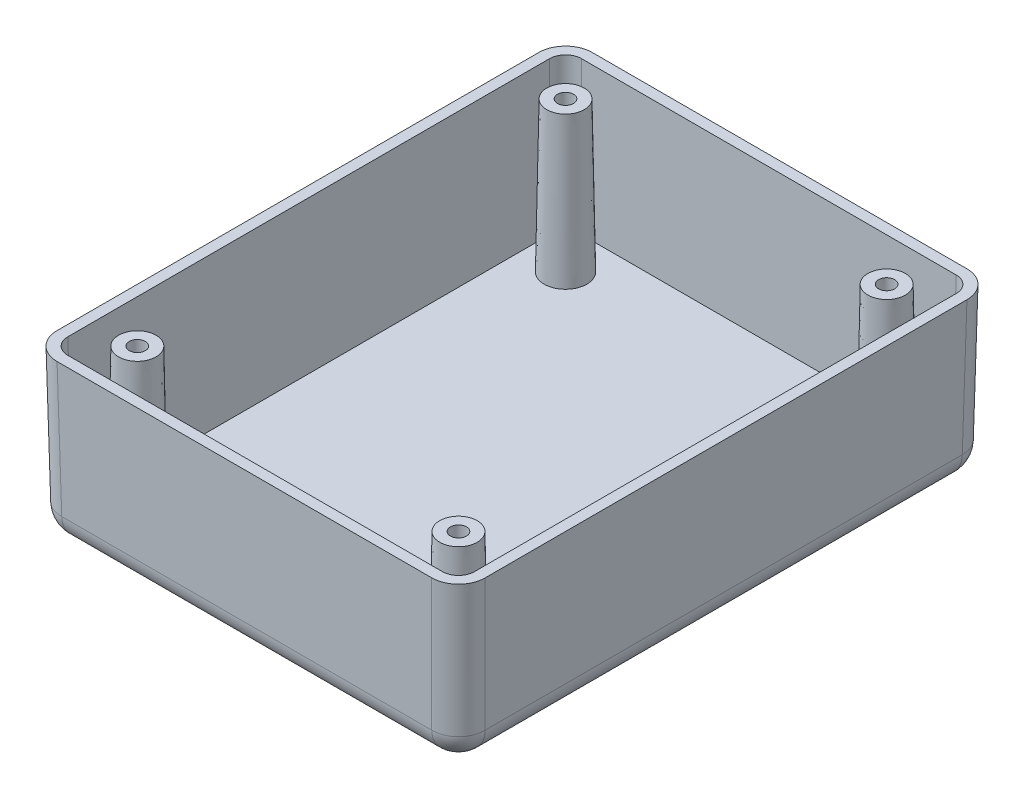
ISO-10303-21;
HEADER;
FILE_DESCRIPTION(('STEP AP214'),'2;1');
FILE_NAME('part.step','',(''),(''),'','','');
FILE_SCHEMA(('AUTOMOTIVE_DESIGN { 1 0 10303 214 1 1 1 1 }'));
ENDSEC;
DATA;
#1=APPLICATION_CONTEXT('core data for automotive mechanical design processes');
#2=APPLICATION_PROTOCOL_DEFINITION('international standard','automotive_design',2000,#1);
#3=PRODUCT_CONTEXT('',#1,'mechanical');
#4=PRODUCT('Part','Part','',(#3));
#5=PRODUCT_RELATED_PRODUCT_CATEGORY('part','',(#4));
#6=PRODUCT_DEFINITION_FORMATION('','',#4);
#7=PRODUCT_DEFINITION_CONTEXT('part definition',#1,'design');
#8=PRODUCT_DEFINITION('design','',#6,#7);
#9=PRODUCT_DEFINITION_SHAPE('','',#8);
#10=(LENGTH_UNIT() NAMED_UNIT(*) SI_UNIT(.MILLI.,.METRE.));
#11=(NAMED_UNIT(*) PLANE_ANGLE_UNIT() SI_UNIT($,.RADIAN.));
#12=(NAMED_UNIT(*) SI_UNIT($,.STERADIAN.) SOLID_ANGLE_UNIT());
#13=UNCERTAINTY_MEASURE_WITH_UNIT(LENGTH_MEASURE(1.E-05),#10,'distance_accuracy_value','');
#14=(GEOMETRIC_REPRESENTATION_CONTEXT(3) GLOBAL_UNCERTAINTY_ASSIGNED_CONTEXT((#13)) GLOBAL_UNIT_ASSIGNED_CONTEXT((#10,
#11,#12)) REPRESENTATION_CONTEXT('',''));
#15=CARTESIAN_POINT('',(0.,0.,0.));
#16=DIRECTION('',(0.,0.,1.));
#17=DIRECTION('',(1.,0.,0.));
#18=AXIS2_PLACEMENT_3D('',#15,#16,#17);
#19=CARTESIAN_POINT('',(-40.,0.,-50.));
#20=DIRECTION('',(-0.999847695156391,-0.0174524064372835,0.));
#21=DIRECTION('',(0.0174524064372835,-0.999847695156391,0.));
#22=AXIS2_PLACEMENT_3D('',#19,#20,#21);
#23=PLANE('',#22);
#24=DIRECTION('',(-0.0174497491606827,0.999695459881888,-0.0174497491606827));
#25=VECTOR('',#24,1.);
#26=CARTESIAN_POINT('',(-40.0015222368495,0.0872088907003297,-45.0022837610676));
#27=LINE('',#26,#25);
#28=CARTESIAN_POINT('',(-40.,0.,-45.0007615242181));
#29=VERTEX_POINT('',#28);
#30=CARTESIAN_POINT('',(-39.562100212357,-25.0872620321864,-44.562861736575));
#31=VERTEX_POINT('',#30);
#32=EDGE_CURVE('E267',#29,#31,#27,.F.);
#33=ORIENTED_EDGE('',*,*,#32,.T.);
#34=DIRECTION('',(0.,0.,1.));
#35=VECTOR('',#34,1.);
#36=CARTESIAN_POINT('',(-39.562100212357,-25.0872620321864,-50.));
#37=LINE('',#36,#35);
#38=CARTESIAN_POINT('',(-39.562100212357,-25.0872620321864,44.562861736575));
#39=VERTEX_POINT('',#38);
#40=EDGE_CURVE('E293',#31,#39,#37,.T.);
#41=ORIENTED_EDGE('',*,*,#40,.T.);
#42=DIRECTION('',(-0.0174497491606827,0.999695459881888,0.0174497491606827));
#43=VECTOR('',#42,1.);
#44=CARTESIAN_POINT('',(-39.9710728622724,-1.6572346105009,44.9718343864904));
#45=LINE('',#44,#43);
#46=CARTESIAN_POINT('',(-40.,0.,45.000761524218));
#47=VERTEX_POINT('',#46);
#48=EDGE_CURVE('E265',#39,#47,#45,.T.);
#49=ORIENTED_EDGE('',*,*,#48,.T.);
#50=DIRECTION('',(0.,0.,1.));
#51=VECTOR('',#50,1.);
#52=CARTESIAN_POINT('',(-40.,0.,-50.));
#53=LINE('',#52,#51);
#54=EDGE_CURVE('E214',#29,#47,#53,.T.);
#55=ORIENTED_EDGE('',*,*,#54,.F.);
#56=EDGE_LOOP('',(#33,#41,#49,#55));
#57=FACE_BOUND('',#56,.T.);
#58=ADVANCED_FACE('F38',(#57),#23,.T.);
#59=CARTESIAN_POINT('',(40.,0.,-50.));
#60=DIRECTION('',(0.,-0.0174524064372835,-0.999847695156391));
#61=DIRECTION('',(0.,0.999847695156391,-0.0174524064372835));
#62=AXIS2_PLACEMENT_3D('',#59,#60,#61);
#63=PLANE('',#62);
#64=DIRECTION('',(0.0174497491606827,0.999695459881888,-0.0174497491606827));
#65=VECTOR('',#64,1.);
#66=CARTESIAN_POINT('',(35.0022837610675,0.0872088907003297,-50.0015222368495));
#67=LINE('',#66,#65);
#68=CARTESIAN_POINT('',(35.000761524218,0.,-50.));
#69=VERTEX_POINT('',#68);
#70=CARTESIAN_POINT('',(34.562861736575,-25.0872620321864,-49.562100212357));
#71=VERTEX_POINT('',#70);
#72=EDGE_CURVE('E263',#69,#71,#67,.F.);
#73=ORIENTED_EDGE('',*,*,#72,.T.);
#74=DIRECTION('',(-1.,0.,0.));
#75=VECTOR('',#74,1.);
#76=CARTESIAN_POINT('',(40.,-25.0872620321864,-49.562100212357));
#77=LINE('',#76,#75);
#78=CARTESIAN_POINT('',(-34.5628617365751,-25.0872620321864,-49.562100212357));
#79=VERTEX_POINT('',#78);
#80=EDGE_CURVE('E11',#71,#79,#77,.T.);
#81=ORIENTED_EDGE('',*,*,#80,.T.);
#82=DIRECTION('',(-0.0174497491606827,0.999695459881888,-0.0174497491606827));
#83=VECTOR('',#82,1.);
#84=CARTESIAN_POINT('',(-34.9779242614059,-1.30834591026065,-49.9771627371879));
#85=LINE('',#84,#83);
#86=CARTESIAN_POINT('',(-35.0007615242181,0.,-50.));
#87=VERTEX_POINT('',#86);
#88=EDGE_CURVE('E261',#79,#87,#85,.T.);
#89=ORIENTED_EDGE('',*,*,#88,.T.);
#90=DIRECTION('',(-1.,0.,0.));
#91=VECTOR('',#90,1.);
#92=CARTESIAN_POINT('',(40.,0.,-50.));
#93=LINE('',#92,#91);
#94=EDGE_CURVE('E241',#69,#87,#93,.T.);
#95=ORIENTED_EDGE('',*,*,#94,.F.);
#96=EDGE_LOOP('',(#73,#81,#89,#95));
#97=FACE_BOUND('',#96,.T.);
#98=ADVANCED_FACE('F411',(#97),#63,.T.);
#99=CARTESIAN_POINT('',(40.,0.,-50.));
#100=DIRECTION('',(0.999847695156391,-0.0174524064372835,0.));
#101=DIRECTION('',(0.0174524064372835,0.999847695156391,0.));
#102=AXIS2_PLACEMENT_3D('',#99,#100,#101);
#103=PLANE('',#102);
#104=DIRECTION('',(0.0174497491606827,0.999695459881888,0.0174497491606827));
#105=VECTOR('',#104,1.);
#106=CARTESIAN_POINT('',(39.9710728622724,-1.6572346105009,44.9718343864904));
#107=LINE('',#106,#105);
#108=CARTESIAN_POINT('',(40.,0.,45.000761524218));
#109=VERTEX_POINT('',#108);
#110=CARTESIAN_POINT('',(39.562100212357,-25.0872620321864,44.562861736575));
#111=VERTEX_POINT('',#110);
#112=EDGE_CURVE('E245',#109,#111,#107,.F.);
#113=ORIENTED_EDGE('',*,*,#112,.T.);
#114=DIRECTION('',(0.,0.,-1.));
#115=VECTOR('',#114,1.);
#116=CARTESIAN_POINT('',(39.5621002123569,-25.0872620321864,-50.));
#117=LINE('',#116,#115);
#118=CARTESIAN_POINT('',(39.562100212357,-25.0872620321864,-44.562861736575));
#119=VERTEX_POINT('',#118);
#120=EDGE_CURVE('E62',#111,#119,#117,.T.);
#121=ORIENTED_EDGE('',*,*,#120,.T.);
#122=DIRECTION('',(0.0174497491606827,0.999695459881888,-0.0174497491606827));
#123=VECTOR('',#122,1.);
#124=CARTESIAN_POINT('',(40.0015222368495,0.0872088907003297,-45.0022837610676));
#125=LINE('',#124,#123);
#126=CARTESIAN_POINT('',(40.,0.,-45.0007615242181));
#127=VERTEX_POINT('',#126);
#128=EDGE_CURVE('E247',#119,#127,#125,.T.);
#129=ORIENTED_EDGE('',*,*,#128,.T.);
#130=DIRECTION('',(0.,0.,-1.));
#131=VECTOR('',#130,1.);
#132=CARTESIAN_POINT('',(40.,0.,-50.));
#133=LINE('',#132,#131);
#134=EDGE_CURVE('E237',#109,#127,#133,.T.);
#135=ORIENTED_EDGE('',*,*,#134,.F.);
#136=EDGE_LOOP('',(#113,#121,#129,#135));
#137=FACE_BOUND('',#136,.T.);
#138=ADVANCED_FACE('F418',(#137),#103,.T.);
#139=CARTESIAN_POINT('',(40.,0.,50.));
#140=DIRECTION('',(0.,-0.0174524064372835,0.999847695156391));
#141=DIRECTION('',(0.,-0.999847695156391,-0.0174524064372835));
#142=AXIS2_PLACEMENT_3D('',#139,#140,#141);
#143=PLANE('',#142);
#144=DIRECTION('',(-0.0174497491606827,0.999695459881888,0.0174497491606827));
#145=VECTOR('',#144,1.);
#146=CARTESIAN_POINT('',(-34.9779242614059,-1.30834591026065,49.9771627371878));
#147=LINE('',#146,#145);
#148=CARTESIAN_POINT('',(-35.000761524218,0.,50.));
#149=VERTEX_POINT('',#148);
#150=CARTESIAN_POINT('',(-34.562861736575,-25.0872620321864,49.562100212357));
#151=VERTEX_POINT('',#150);
#152=EDGE_CURVE('E272',#149,#151,#147,.F.);
#153=ORIENTED_EDGE('',*,*,#152,.T.);
#154=DIRECTION('',(1.,0.,0.));
#155=VECTOR('',#154,1.);
#156=CARTESIAN_POINT('',(40.,-25.0872620321864,49.562100212357));
#157=LINE('',#156,#155);
#158=CARTESIAN_POINT('',(34.562861736575,-25.0872620321864,49.562100212357));
#159=VERTEX_POINT('',#158);
#160=EDGE_CURVE('E306',#151,#159,#157,.T.);
#161=ORIENTED_EDGE('',*,*,#160,.T.);
#162=DIRECTION('',(0.0174497491606827,0.999695459881888,0.0174497491606827));
#163=VECTOR('',#162,1.);
#164=CARTESIAN_POINT('',(35.0022837610675,0.0872088907003298,50.0015222368495));
#165=LINE('',#164,#163);
#166=CARTESIAN_POINT('',(35.000761524218,0.,50.));
#167=VERTEX_POINT('',#166);
#168=EDGE_CURVE('E270',#159,#167,#165,.T.);
#169=ORIENTED_EDGE('',*,*,#168,.T.);
#170=DIRECTION('',(1.,0.,0.));
#171=VECTOR('',#170,1.);
#172=CARTESIAN_POINT('',(40.,0.,50.));
#173=LINE('',#172,#171);
#174=EDGE_CURVE('E233',#149,#167,#173,.T.);
#175=ORIENTED_EDGE('',*,*,#174,.F.);
#176=EDGE_LOOP('',(#153,#161,#169,#175));
#177=FACE_BOUND('',#176,.T.);
#178=ADVANCED_FACE('F424',(#177),#143,.T.);
#179=CARTESIAN_POINT('',(0.,-30.,0.));
#180=DIRECTION('',(0.,-1.,0.));
#181=DIRECTION('',(0.,0.,-1.));
#182=AXIS2_PLACEMENT_3D('',#179,#180,#181);
#183=PLANE('',#182);
#184=DIRECTION('',(1.,0.,0.));
#185=VECTOR('',#184,1.);
#186=CARTESIAN_POINT('',(0.,-30.,44.562861736575));
#187=LINE('',#186,#185);
#188=CARTESIAN_POINT('',(34.562861736575,-30.,44.562861736575));
#189=VERTEX_POINT('',#188);
#190=CARTESIAN_POINT('',(-34.562861736575,-30.,44.562861736575));
#191=VERTEX_POINT('',#190);
#192=EDGE_CURVE('E299',#189,#191,#187,.F.);
#193=ORIENTED_EDGE('',*,*,#192,.T.);
#194=DIRECTION('',(0.,0.,1.));
#195=VECTOR('',#194,1.);
#196=CARTESIAN_POINT('',(-34.562861736575,-30.,0.));
#197=LINE('',#196,#195);
#198=CARTESIAN_POINT('',(-34.5628617365751,-30.,-44.562861736575));
#199=VERTEX_POINT('',#198);
#200=EDGE_CURVE('E301',#191,#199,#197,.F.);
#201=ORIENTED_EDGE('',*,*,#200,.T.);
#202=DIRECTION('',(-1.,0.,0.));
#203=VECTOR('',#202,1.);
#204=CARTESIAN_POINT('',(0.,-30.,-44.562861736575));
#205=LINE('',#204,#203);
#206=CARTESIAN_POINT('',(34.562861736575,-30.,-44.562861736575));
#207=VERTEX_POINT('',#206);
#208=EDGE_CURVE('E295',#199,#207,#205,.F.);
#209=ORIENTED_EDGE('',*,*,#208,.T.);
#210=DIRECTION('',(0.,0.,-1.));
#211=VECTOR('',#210,1.);
#212=CARTESIAN_POINT('',(34.562861736575,-30.,0.));
#213=LINE('',#212,#211);
#214=EDGE_CURVE('E297',#207,#189,#213,.F.);
#215=ORIENTED_EDGE('',*,*,#214,.T.);
#216=EDGE_LOOP('',(#193,#201,#209,#215));
#217=FACE_BOUND('',#216,.T.);
#218=ADVANCED_FACE('F427',(#217),#183,.T.);
#219=CARTESIAN_POINT('',(0.,0.,0.));
#220=DIRECTION('',(0.,-1.,0.));
#221=DIRECTION('',(0.,0.,-1.));
#222=AXIS2_PLACEMENT_3D('',#219,#220,#221);
#223=PLANE('',#222);
#224=DIRECTION('',(0.,0.,-1.));
#225=VECTOR('',#224,1.);
#226=CARTESIAN_POINT('',(37.9996953439122,0.,-50.));
#227=LINE('',#226,#225);
#228=CARTESIAN_POINT('',(37.9996953439122,0.,45.000152258443));
#229=VERTEX_POINT('',#228);
#230=CARTESIAN_POINT('',(37.9996953439122,0.,-45.000152258443));
#231=VERTEX_POINT('',#230);
#232=EDGE_CURVE('E222',#229,#231,#227,.T.);
#233=ORIENTED_EDGE('',*,*,#232,.F.);
#234=CARTESIAN_POINT('',(34.9992383597804,0.,44.9992383597804));
#235=DIRECTION('',(0.,-1.,0.));
#236=DIRECTION('',(0.707106781186548,0.,0.707106781186547));
#237=AXIS2_PLACEMENT_3D('',#234,#235,#236);
#238=ELLIPSE('',#237,3.00091389867315,3.);
#239=CARTESIAN_POINT('',(35.000152258443,0.,47.9996953439122));
#240=VERTEX_POINT('',#239);
#241=EDGE_CURVE('E207',#240,#229,#238,.F.);
#242=ORIENTED_EDGE('',*,*,#241,.F.);
#243=DIRECTION('',(1.,0.,0.));
#244=VECTOR('',#243,1.);
#245=CARTESIAN_POINT('',(40.,0.,47.9996953439122));
#246=LINE('',#245,#244);
#247=CARTESIAN_POINT('',(-35.000152258443,0.,47.9996953439122));
#248=VERTEX_POINT('',#247);
#249=EDGE_CURVE('E217',#248,#240,#246,.T.);
#250=ORIENTED_EDGE('',*,*,#249,.F.);
#251=CARTESIAN_POINT('',(-34.9992383597805,0.,44.9992383597804));
#252=DIRECTION('',(0.,-1.,0.));
#253=DIRECTION('',(-0.707106781186547,0.,0.707106781186548));
#254=AXIS2_PLACEMENT_3D('',#251,#252,#253);
#255=ELLIPSE('',#254,3.00091389867315,3.);
#256=CARTESIAN_POINT('',(-37.9996953439122,0.,45.000152258443));
#257=VERTEX_POINT('',#256);
#258=EDGE_CURVE('E219',#257,#248,#255,.F.);
#259=ORIENTED_EDGE('',*,*,#258,.F.);
#260=DIRECTION('',(0.,0.,1.));
#261=VECTOR('',#260,1.);
#262=CARTESIAN_POINT('',(-37.9996953439122,0.,-50.));
#263=LINE('',#262,#261);
#264=CARTESIAN_POINT('',(-37.9996953439122,0.,-45.000152258443));
#265=VERTEX_POINT('',#264);
#266=EDGE_CURVE('E215',#265,#257,#263,.T.);
#267=ORIENTED_EDGE('',*,*,#266,.F.);
#268=CARTESIAN_POINT('',(-34.9992383597805,0.,-44.9992383597805));
#269=DIRECTION('',(0.,-1.,0.));
#270=DIRECTION('',(-0.707106781186548,0.,-0.707106781186547));
#271=AXIS2_PLACEMENT_3D('',#268,#269,#270);
#272=ELLIPSE('',#271,3.00091389867315,3.);
#273=CARTESIAN_POINT('',(-35.000152258443,0.,-47.9996953439122));
#274=VERTEX_POINT('',#273);
#275=EDGE_CURVE('E171',#274,#265,#272,.F.);
#276=ORIENTED_EDGE('',*,*,#275,.F.);
#277=DIRECTION('',(-1.,0.,0.));
#278=VECTOR('',#277,1.);
#279=CARTESIAN_POINT('',(40.,0.,-47.9996953439122));
#280=LINE('',#279,#278);
#281=CARTESIAN_POINT('',(35.000152258443,0.,-47.9996953439122));
#282=VERTEX_POINT('',#281);
#283=EDGE_CURVE('E185',#282,#274,#280,.T.);
#284=ORIENTED_EDGE('',*,*,#283,.F.);
#285=CARTESIAN_POINT('',(34.9992383597804,0.,-44.9992383597805));
#286=DIRECTION('',(0.,-1.,0.));
#287=DIRECTION('',(0.707106781186547,0.,-0.707106781186548));
#288=AXIS2_PLACEMENT_3D('',#285,#286,#287);
#289=ELLIPSE('',#288,3.00091389867315,3.);
#290=EDGE_CURVE('E204',#231,#282,#289,.F.);
#291=ORIENTED_EDGE('',*,*,#290,.F.);
#292=EDGE_LOOP('',(#233,#242,#250,#259,#267,#276,#284,#291));
#293=FACE_BOUND('',#292,.T.);
#294=ORIENTED_EDGE('',*,*,#134,.T.);
#295=CARTESIAN_POINT('',(34.9992383597804,0.,-44.9992383597805));
#296=DIRECTION('',(0.,-1.,0.));
#297=DIRECTION('',(0.707106781186547,0.,-0.707106781186548));
#298=AXIS2_PLACEMENT_3D('',#295,#296,#297);
#299=ELLIPSE('',#298,5.00152316445525,5.);
#300=EDGE_CURVE('E258',#127,#69,#299,.F.);
#301=ORIENTED_EDGE('',*,*,#300,.T.);
#302=ORIENTED_EDGE('',*,*,#94,.T.);
#303=CARTESIAN_POINT('',(-34.9992383597805,0.,-44.9992383597805));
#304=DIRECTION('',(0.,-1.,0.));
#305=DIRECTION('',(-0.707106781186548,0.,-0.707106781186547));
#306=AXIS2_PLACEMENT_3D('',#303,#304,#305);
#307=ELLIPSE('',#306,5.00152316445525,5.);
#308=EDGE_CURVE('E255',#87,#29,#307,.F.);
#309=ORIENTED_EDGE('',*,*,#308,.T.);
#310=ORIENTED_EDGE('',*,*,#54,.T.);
#311=CARTESIAN_POINT('',(-34.9992383597805,0.,44.9992383597804));
#312=DIRECTION('',(0.,-1.,0.));
#313=DIRECTION('',(-0.707106781186547,0.,0.707106781186548));
#314=AXIS2_PLACEMENT_3D('',#311,#312,#313);
#315=ELLIPSE('',#314,5.00152316445525,5.);
#316=EDGE_CURVE('E252',#47,#149,#315,.F.);
#317=ORIENTED_EDGE('',*,*,#316,.T.);
#318=ORIENTED_EDGE('',*,*,#174,.T.);
#319=CARTESIAN_POINT('',(34.9992383597804,0.,44.9992383597804));
#320=DIRECTION('',(0.,-1.,0.));
#321=DIRECTION('',(0.707106781186548,0.,0.707106781186547));
#322=AXIS2_PLACEMENT_3D('',#319,#320,#321);
#323=ELLIPSE('',#322,5.00152316445525,5.);
#324=EDGE_CURVE('E249',#167,#109,#323,.F.);
#325=ORIENTED_EDGE('',*,*,#324,.T.);
#326=EDGE_LOOP('',(#294,#301,#302,#309,#310,#317,#318,#325));
#327=FACE_BOUND('',#326,.T.);
#328=ADVANCED_FACE('F384',(#293,#327),#223,.F.);
#329=CARTESIAN_POINT('',(35.0022837610675,0.174470922886748,-45.0022837610676));
#330=DIRECTION('',(0.0174497491606827,0.999695459881887,-0.0174497491606827));
#331=DIRECTION('',(0.,0.0174524064372835,0.999847695156391));
#332=AXIS2_PLACEMENT_3D('',#329,#330,#331);
#333=CYLINDRICAL_SURFACE('',#332,5.);
#334=ORIENTED_EDGE('',*,*,#128,.F.);
#335=CARTESIAN_POINT('',(34.562861736575,-25.,-44.562861736575));
#336=DIRECTION('',(0.0174497491606827,0.999695459881887,-0.0174497491606827));
#337=DIRECTION('',(0.,0.0174524064372835,0.999847695156391));
#338=AXIS2_PLACEMENT_3D('',#335,#336,#337);
#339=CIRCLE('',#338,5.);
#340=EDGE_CURVE('E47',#119,#71,#339,.T.);
#341=ORIENTED_EDGE('',*,*,#340,.T.);
#342=ORIENTED_EDGE('',*,*,#72,.F.);
#343=ORIENTED_EDGE('',*,*,#300,.F.);
#344=EDGE_LOOP('',(#334,#341,#342,#343));
#345=FACE_BOUND('',#344,.T.);
#346=ADVANCED_FACE('F431',(#345),#333,.T.);
#347=CARTESIAN_POINT('',(-34.9779242614059,-1.22108387807424,-44.9779242614059));
#348=DIRECTION('',(-0.0174497491606827,0.999695459881887,-0.0174497491606827));
#349=DIRECTION('',(-0.999847695156391,-0.0174524064372836,0.));
#350=AXIS2_PLACEMENT_3D('',#347,#348,#349);
#351=CYLINDRICAL_SURFACE('',#350,5.);
#352=ORIENTED_EDGE('',*,*,#88,.F.);
#353=CARTESIAN_POINT('',(-34.5628617365751,-25.,-44.562861736575));
#354=DIRECTION('',(-0.0174497491606827,0.999695459881887,-0.0174497491606827));
#355=DIRECTION('',(-0.999847695156391,-0.0174524064372836,0.));
#356=AXIS2_PLACEMENT_3D('',#353,#354,#355);
#357=CIRCLE('',#356,5.);
#358=EDGE_CURVE('E275',#79,#31,#357,.T.);
#359=ORIENTED_EDGE('',*,*,#358,.T.);
#360=ORIENTED_EDGE('',*,*,#32,.F.);
#361=ORIENTED_EDGE('',*,*,#308,.F.);
#362=EDGE_LOOP('',(#352,#359,#360,#361));
#363=FACE_BOUND('',#362,.T.);
#364=ADVANCED_FACE('F434',(#363),#351,.T.);
#365=CARTESIAN_POINT('',(-34.9718343864905,-1.56997257831448,44.9718343864904));
#366=DIRECTION('',(-0.0174497491606827,0.999695459881887,0.0174497491606827));
#367=DIRECTION('',(0.,-0.0174524064372835,0.999847695156391));
#368=AXIS2_PLACEMENT_3D('',#365,#366,#367);
#369=CYLINDRICAL_SURFACE('',#368,5.);
#370=ORIENTED_EDGE('',*,*,#48,.F.);
#371=CARTESIAN_POINT('',(-34.562861736575,-25.,44.562861736575));
#372=DIRECTION('',(-0.0174497491606827,0.999695459881887,0.0174497491606827));
#373=DIRECTION('',(0.,-0.0174524064372835,0.999847695156391));
#374=AXIS2_PLACEMENT_3D('',#371,#372,#373);
#375=CIRCLE('',#374,5.);
#376=EDGE_CURVE('E304',#39,#151,#375,.T.);
#377=ORIENTED_EDGE('',*,*,#376,.T.);
#378=ORIENTED_EDGE('',*,*,#152,.F.);
#379=ORIENTED_EDGE('',*,*,#316,.F.);
#380=EDGE_LOOP('',(#370,#377,#378,#379));
#381=FACE_BOUND('',#380,.T.);
#382=ADVANCED_FACE('F437',(#381),#369,.T.);
#383=CARTESIAN_POINT('',(35.0022837610675,0.174470922886748,45.0022837610675));
#384=DIRECTION('',(0.0174497491606827,0.999695459881887,0.0174497491606827));
#385=DIRECTION('',(-0.999847695156391,0.0174524064372836,0.));
#386=AXIS2_PLACEMENT_3D('',#383,#384,#385);
#387=CYLINDRICAL_SURFACE('',#386,5.);
#388=ORIENTED_EDGE('',*,*,#168,.F.);
#389=CARTESIAN_POINT('',(34.562861736575,-25.,44.562861736575));
#390=DIRECTION('',(0.0174497491606827,0.999695459881887,0.0174497491606827));
#391=DIRECTION('',(-0.999847695156391,0.0174524064372836,0.));
#392=AXIS2_PLACEMENT_3D('',#389,#390,#391);
#393=CIRCLE('',#392,5.);
#394=EDGE_CURVE('E308',#159,#111,#393,.T.);
#395=ORIENTED_EDGE('',*,*,#394,.T.);
#396=ORIENTED_EDGE('',*,*,#112,.F.);
#397=ORIENTED_EDGE('',*,*,#324,.F.);
#398=EDGE_LOOP('',(#388,#395,#396,#397));
#399=FACE_BOUND('',#398,.T.);
#400=ADVANCED_FACE('F441',(#399),#387,.T.);
#401=CARTESIAN_POINT('',(-38.0003046096872,0.0349048128745671,-50.));
#402=DIRECTION('',(-0.999847695156391,-0.0174524064372835,0.));
#403=DIRECTION('',(0.0174524064372835,-0.999847695156391,0.));
#404=AXIS2_PLACEMENT_3D('',#401,#402,#403);
#405=PLANE('',#404);
#406=ORIENTED_EDGE('',*,*,#266,.T.);
#407=DIRECTION('',(-0.0174497491606827,0.999695459881887,0.0174497491606827));
#408=VECTOR('',#407,1.);
#409=CARTESIAN_POINT('',(-37.9713774719596,-1.62232979762633,44.9718343864904));
#410=LINE('',#409,#408);
#411=CARTESIAN_POINT('',(-37.5109535259221,-28.,44.5114104404529));
#412=VERTEX_POINT('',#411);
#413=EDGE_CURVE('E176',#412,#257,#410,.T.);
#414=ORIENTED_EDGE('',*,*,#413,.F.);
#415=DIRECTION('',(0.,0.,1.));
#416=VECTOR('',#415,1.);
#417=CARTESIAN_POINT('',(-37.5109535259221,-28.,-50.));
#418=LINE('',#417,#416);
#419=CARTESIAN_POINT('',(-37.5109535259221,-28.,-44.5114104404529));
#420=VERTEX_POINT('',#419);
#421=EDGE_CURVE('E180',#420,#412,#418,.T.);
#422=ORIENTED_EDGE('',*,*,#421,.F.);
#423=DIRECTION('',(-0.0174497491606827,0.999695459881887,-0.0174497491606827));
#424=VECTOR('',#423,1.);
#425=CARTESIAN_POINT('',(-37.9774673468751,-1.27344109738609,-44.9779242614059));
#426=LINE('',#425,#424);
#427=EDGE_CURVE('E164',#265,#420,#426,.F.);
#428=ORIENTED_EDGE('',*,*,#427,.F.);
#429=EDGE_LOOP('',(#406,#414,#422,#428));
#430=FACE_BOUND('',#429,.T.);
#431=ADVANCED_FACE('F181',(#430),#405,.F.);
#432=CARTESIAN_POINT('',(40.,0.0349048128745671,-48.0003046096872));
#433=DIRECTION('',(0.,-0.0174524064372835,-0.999847695156391));
#434=DIRECTION('',(0.,0.999847695156391,-0.0174524064372835));
#435=AXIS2_PLACEMENT_3D('',#432,#433,#434);
#436=PLANE('',#435);
#437=ORIENTED_EDGE('',*,*,#283,.T.);
#438=DIRECTION('',(-0.0174497491606827,0.999695459881887,-0.0174497491606827));
#439=VECTOR('',#438,1.);
#440=CARTESIAN_POINT('',(-34.9779242614059,-1.27344109738609,-47.9774673468751));
#441=LINE('',#440,#439);
#442=CARTESIAN_POINT('',(-34.5114104404529,-28.,-47.5109535259221));
#443=VERTEX_POINT('',#442);
#444=EDGE_CURVE('E202',#443,#274,#441,.T.);
#445=ORIENTED_EDGE('',*,*,#444,.F.);
#446=DIRECTION('',(-1.,0.,0.));
#447=VECTOR('',#446,1.);
#448=CARTESIAN_POINT('',(40.,-28.,-47.5109535259221));
#449=LINE('',#448,#447);
#450=CARTESIAN_POINT('',(34.5114104404529,-28.,-47.5109535259221));
#451=VERTEX_POINT('',#450);
#452=EDGE_CURVE('E190',#451,#443,#449,.T.);
#453=ORIENTED_EDGE('',*,*,#452,.F.);
#454=DIRECTION('',(0.0174497491606827,0.999695459881887,-0.0174497491606827));
#455=VECTOR('',#454,1.);
#456=CARTESIAN_POINT('',(35.0022837610675,0.122113703574897,-48.0018268465367));
#457=LINE('',#456,#455);
#458=EDGE_CURVE('E200',#282,#451,#457,.F.);
#459=ORIENTED_EDGE('',*,*,#458,.F.);
#460=EDGE_LOOP('',(#437,#445,#453,#459));
#461=FACE_BOUND('',#460,.T.);
#462=ADVANCED_FACE('F397',(#461),#436,.F.);
#463=CARTESIAN_POINT('',(38.0003046096872,0.0349048128745671,-50.));
#464=DIRECTION('',(0.999847695156391,-0.0174524064372835,0.));
#465=DIRECTION('',(0.0174524064372835,0.999847695156391,0.));
#466=AXIS2_PLACEMENT_3D('',#463,#464,#465);
#467=PLANE('',#466);
#468=DIRECTION('',(0.,0.,-1.));
#469=VECTOR('',#468,1.);
#470=CARTESIAN_POINT('',(37.5109535259221,-28.,-50.));
#471=LINE('',#470,#469);
#472=CARTESIAN_POINT('',(37.5109535259221,-28.,44.5114104404529));
#473=VERTEX_POINT('',#472);
#474=CARTESIAN_POINT('',(37.5109535259221,-28.,-44.5114104404529));
#475=VERTEX_POINT('',#474);
#476=EDGE_CURVE('E366',#473,#475,#471,.T.);
#477=ORIENTED_EDGE('',*,*,#476,.F.);
#478=DIRECTION('',(0.0174497491606827,0.999695459881887,0.0174497491606827));
#479=VECTOR('',#478,1.);
#480=CARTESIAN_POINT('',(38.0018268465367,0.122113703574897,45.0022837610675));
#481=LINE('',#480,#479);
#482=EDGE_CURVE('E208',#229,#473,#481,.F.);
#483=ORIENTED_EDGE('',*,*,#482,.F.);
#484=ORIENTED_EDGE('',*,*,#232,.T.);
#485=DIRECTION('',(0.0174497491606827,0.999695459881887,-0.0174497491606827));
#486=VECTOR('',#485,1.);
#487=CARTESIAN_POINT('',(38.0018268465367,0.122113703574897,-45.0022837610676));
#488=LINE('',#487,#486);
#489=EDGE_CURVE('E205',#475,#231,#488,.T.);
#490=ORIENTED_EDGE('',*,*,#489,.F.);
#491=EDGE_LOOP('',(#477,#483,#484,#490));
#492=FACE_BOUND('',#491,.T.);
#493=ADVANCED_FACE('F392',(#492),#467,.F.);
#494=CARTESIAN_POINT('',(40.,0.0349048128745671,48.0003046096872));
#495=DIRECTION('',(0.,-0.0174524064372835,0.999847695156391));
#496=DIRECTION('',(0.,-0.999847695156391,-0.0174524064372835));
#497=AXIS2_PLACEMENT_3D('',#494,#495,#496);
#498=PLANE('',#497);
#499=ORIENTED_EDGE('',*,*,#249,.T.);
#500=DIRECTION('',(0.0174497491606827,0.999695459881887,0.0174497491606827));
#501=VECTOR('',#500,1.);
#502=CARTESIAN_POINT('',(35.0022837610675,0.122113703574897,48.0018268465367));
#503=LINE('',#502,#501);
#504=CARTESIAN_POINT('',(34.5114104404529,-28.,47.5109535259221));
#505=VERTEX_POINT('',#504);
#506=EDGE_CURVE('E175',#505,#240,#503,.T.);
#507=ORIENTED_EDGE('',*,*,#506,.F.);
#508=DIRECTION('',(1.,0.,0.));
#509=VECTOR('',#508,1.);
#510=CARTESIAN_POINT('',(40.,-28.,47.5109535259221));
#511=LINE('',#510,#509);
#512=CARTESIAN_POINT('',(-34.5114104404529,-28.,47.5109535259221));
#513=VERTEX_POINT('',#512);
#514=EDGE_CURVE('E184',#513,#505,#511,.T.);
#515=ORIENTED_EDGE('',*,*,#514,.F.);
#516=DIRECTION('',(-0.0174497491606827,0.999695459881887,0.0174497491606827));
#517=VECTOR('',#516,1.);
#518=CARTESIAN_POINT('',(-34.9718343864905,-1.62232979762633,47.9713774719596));
#519=LINE('',#518,#517);
#520=EDGE_CURVE('E212',#248,#513,#519,.F.);
#521=ORIENTED_EDGE('',*,*,#520,.F.);
#522=EDGE_LOOP('',(#499,#507,#515,#521));
#523=FACE_BOUND('',#522,.T.);
#524=ADVANCED_FACE('F376',(#523),#498,.F.);
#525=CARTESIAN_POINT('',(0.,-28.,0.));
#526=DIRECTION('',(0.,-1.,0.));
#527=DIRECTION('',(0.,0.,-1.));
#528=AXIS2_PLACEMENT_3D('',#525,#526,#527);
#529=PLANE('',#528);
#530=CARTESIAN_POINT('',(30.,-28.,40.));
#531=DIRECTION('',(0.,-1.,0.));
#532=DIRECTION('',(0.,0.,-1.));
#533=AXIS2_PLACEMENT_3D('',#530,#531,#532);
#534=CIRCLE('',#533,3.98874181799009);
#535=CARTESIAN_POINT('',(30.,-28.,36.0112581820099));
#536=VERTEX_POINT('',#535);
#537=EDGE_CURVE('E287',#536,#536,#534,.T.);
#538=ORIENTED_EDGE('',*,*,#537,.T.);
#539=EDGE_LOOP('',(#538));
#540=FACE_BOUND('',#539,.T.);
#541=CARTESIAN_POINT('',(30.,-28.,-40.));
#542=DIRECTION('',(0.,-1.,0.));
#543=DIRECTION('',(0.,0.,-1.));
#544=AXIS2_PLACEMENT_3D('',#541,#542,#543);
#545=CIRCLE('',#544,3.98874181799009);
#546=CARTESIAN_POINT('',(30.,-28.,-43.9887418179901));
#547=VERTEX_POINT('',#546);
#548=EDGE_CURVE('E283',#547,#547,#545,.T.);
#549=ORIENTED_EDGE('',*,*,#548,.T.);
#550=EDGE_LOOP('',(#549));
#551=FACE_BOUND('',#550,.T.);
#552=CARTESIAN_POINT('',(-30.,-28.,-40.));
#553=DIRECTION('',(0.,-1.,0.));
#554=DIRECTION('',(0.,0.,-1.));
#555=AXIS2_PLACEMENT_3D('',#552,#553,#554);
#556=CIRCLE('',#555,3.98874181799009);
#557=CARTESIAN_POINT('',(-30.,-28.,-43.9887418179901));
#558=VERTEX_POINT('',#557);
#559=EDGE_CURVE('E279',#558,#558,#556,.T.);
#560=ORIENTED_EDGE('',*,*,#559,.T.);
#561=EDGE_LOOP('',(#560));
#562=FACE_BOUND('',#561,.T.);
#563=CARTESIAN_POINT('',(-30.,-28.,40.));
#564=DIRECTION('',(0.,-1.,0.));
#565=DIRECTION('',(0.,0.,-1.));
#566=AXIS2_PLACEMENT_3D('',#563,#564,#565);
#567=CIRCLE('',#566,3.98874181799009);
#568=CARTESIAN_POINT('',(-30.,-28.,36.0112581820099));
#569=VERTEX_POINT('',#568);
#570=EDGE_CURVE('E218',#569,#569,#567,.T.);
#571=ORIENTED_EDGE('',*,*,#570,.T.);
#572=EDGE_LOOP('',(#571));
#573=FACE_BOUND('',#572,.T.);
#574=ORIENTED_EDGE('',*,*,#452,.T.);
#575=CARTESIAN_POINT('',(-34.5104965417904,-28.,-44.5104965417904));
#576=DIRECTION('',(0.,-1.,0.));
#577=DIRECTION('',(-0.707106781186548,0.,-0.707106781186547));
#578=AXIS2_PLACEMENT_3D('',#575,#576,#577);
#579=ELLIPSE('',#578,3.00091389867315,3.);
#580=EDGE_CURVE('E168',#420,#443,#579,.T.);
#581=ORIENTED_EDGE('',*,*,#580,.F.);
#582=ORIENTED_EDGE('',*,*,#421,.T.);
#583=CARTESIAN_POINT('',(-34.5104965417904,-28.,44.5104965417904));
#584=DIRECTION('',(0.,-1.,0.));
#585=DIRECTION('',(-0.707106781186547,0.,0.707106781186548));
#586=AXIS2_PLACEMENT_3D('',#583,#584,#585);
#587=ELLIPSE('',#586,3.00091389867315,3.);
#588=EDGE_CURVE('E193',#513,#412,#587,.T.);
#589=ORIENTED_EDGE('',*,*,#588,.F.);
#590=ORIENTED_EDGE('',*,*,#514,.T.);
#591=CARTESIAN_POINT('',(34.5104965417904,-28.,44.5104965417904));
#592=DIRECTION('',(0.,-1.,0.));
#593=DIRECTION('',(0.707106781186548,0.,0.707106781186547));
#594=AXIS2_PLACEMENT_3D('',#591,#592,#593);
#595=ELLIPSE('',#594,3.00091389867315,3.);
#596=EDGE_CURVE('E196',#473,#505,#595,.T.);
#597=ORIENTED_EDGE('',*,*,#596,.F.);
#598=ORIENTED_EDGE('',*,*,#476,.T.);
#599=CARTESIAN_POINT('',(34.5104965417903,-28.,-44.5104965417904));
#600=DIRECTION('',(0.,-1.,0.));
#601=DIRECTION('',(0.707106781186547,0.,-0.707106781186548));
#602=AXIS2_PLACEMENT_3D('',#599,#600,#601);
#603=ELLIPSE('',#602,3.00091389867315,3.);
#604=EDGE_CURVE('E192',#451,#475,#603,.T.);
#605=ORIENTED_EDGE('',*,*,#604,.F.);
#606=EDGE_LOOP('',(#574,#581,#582,#589,#590,#597,#598,#605));
#607=FACE_BOUND('',#606,.T.);
#608=ADVANCED_FACE('F187',(#540,#551,#562,#573,#607),#529,.F.);
#609=CARTESIAN_POINT('',(35.0022837610675,0.174470922886748,-45.0022837610676));
#610=DIRECTION('',(0.0174497491606827,0.999695459881887,-0.0174497491606827));
#611=DIRECTION('',(0.,0.0174524064372835,0.999847695156391));
#612=AXIS2_PLACEMENT_3D('',#609,#610,#611);
#613=CYLINDRICAL_SURFACE('',#612,3.);
#614=ORIENTED_EDGE('',*,*,#604,.T.);
#615=ORIENTED_EDGE('',*,*,#489,.T.);
#616=ORIENTED_EDGE('',*,*,#290,.T.);
#617=ORIENTED_EDGE('',*,*,#458,.T.);
#618=EDGE_LOOP('',(#614,#615,#616,#617));
#619=FACE_BOUND('',#618,.T.);
#620=ADVANCED_FACE('F394',(#619),#613,.F.);
#621=CARTESIAN_POINT('',(-34.9779242614059,-1.22108387807424,-44.9779242614059));
#622=DIRECTION('',(-0.0174497491606827,0.999695459881887,-0.0174497491606827));
#623=DIRECTION('',(-0.999847695156391,-0.0174524064372836,0.));
#624=AXIS2_PLACEMENT_3D('',#621,#622,#623);
#625=CYLINDRICAL_SURFACE('',#624,3.);
#626=ORIENTED_EDGE('',*,*,#580,.T.);
#627=ORIENTED_EDGE('',*,*,#444,.T.);
#628=ORIENTED_EDGE('',*,*,#275,.T.);
#629=ORIENTED_EDGE('',*,*,#427,.T.);
#630=EDGE_LOOP('',(#626,#627,#628,#629));
#631=FACE_BOUND('',#630,.T.);
#632=ADVANCED_FACE('F166',(#631),#625,.F.);
#633=CARTESIAN_POINT('',(-34.9718343864905,-1.56997257831448,44.9718343864904));
#634=DIRECTION('',(-0.0174497491606827,0.999695459881887,0.0174497491606827));
#635=DIRECTION('',(0.,-0.0174524064372835,0.999847695156391));
#636=AXIS2_PLACEMENT_3D('',#633,#634,#635);
#637=CYLINDRICAL_SURFACE('',#636,3.);
#638=ORIENTED_EDGE('',*,*,#588,.T.);
#639=ORIENTED_EDGE('',*,*,#413,.T.);
#640=ORIENTED_EDGE('',*,*,#258,.T.);
#641=ORIENTED_EDGE('',*,*,#520,.T.);
#642=EDGE_LOOP('',(#638,#639,#640,#641));
#643=FACE_BOUND('',#642,.T.);
#644=ADVANCED_FACE('F399',(#643),#637,.F.);
#645=CARTESIAN_POINT('',(35.0022837610675,0.174470922886748,45.0022837610675));
#646=DIRECTION('',(0.0174497491606827,0.999695459881887,0.0174497491606827));
#647=DIRECTION('',(-0.999847695156391,0.0174524064372836,0.));
#648=AXIS2_PLACEMENT_3D('',#645,#646,#647);
#649=CYLINDRICAL_SURFACE('',#648,3.);
#650=ORIENTED_EDGE('',*,*,#596,.T.);
#651=ORIENTED_EDGE('',*,*,#506,.T.);
#652=ORIENTED_EDGE('',*,*,#241,.T.);
#653=ORIENTED_EDGE('',*,*,#482,.T.);
#654=EDGE_LOOP('',(#650,#651,#652,#653));
#655=FACE_BOUND('',#654,.T.);
#656=ADVANCED_FACE('F380',(#655),#649,.F.);
#657=CARTESIAN_POINT('',(-30.,0.,40.));
#658=DIRECTION('',(0.,-1.,0.));
#659=DIRECTION('',(0.,0.,1.));
#660=AXIS2_PLACEMENT_3D('',#657,#658,#659);
#661=CONICAL_SURFACE('',#660,3.5,0.0174532925199433);
#662=CARTESIAN_POINT('',(-30.,0.,40.));
#663=DIRECTION('',(0.,1.,0.));
#664=DIRECTION('',(0.,0.,1.));
#665=AXIS2_PLACEMENT_3D('',#662,#663,#664);
#666=CIRCLE('',#665,3.5);
#667=CARTESIAN_POINT('',(-30.,0.,43.5));
#668=VERTEX_POINT('',#667);
#669=EDGE_CURVE('E278',#668,#668,#666,.T.);
#670=ORIENTED_EDGE('',*,*,#669,.F.);
#671=EDGE_LOOP('',(#670));
#672=FACE_BOUND('',#671,.T.);
#673=ORIENTED_EDGE('',*,*,#570,.F.);
#674=EDGE_LOOP('',(#673));
#675=FACE_BOUND('',#674,.T.);
#676=ADVANCED_FACE('F407',(#672,#675),#661,.T.);
#677=CARTESIAN_POINT('',(-30.,0.,40.));
#678=DIRECTION('',(0.,1.,0.));
#679=DIRECTION('',(0.,0.,1.));
#680=AXIS2_PLACEMENT_3D('',#677,#678,#679);
#681=PLANE('',#680);
#682=CARTESIAN_POINT('',(-30.,0.,40.));
#683=DIRECTION('',(0.,1.,0.));
#684=DIRECTION('',(0.,0.,1.));
#685=AXIS2_PLACEMENT_3D('',#682,#683,#684);
#686=CIRCLE('',#685,1.5);
#687=CARTESIAN_POINT('',(-30.,0.,41.5));
#688=VERTEX_POINT('',#687);
#689=EDGE_CURVE('E350',#688,#688,#686,.T.);
#690=ORIENTED_EDGE('',*,*,#689,.F.);
#691=EDGE_LOOP('',(#690));
#692=FACE_BOUND('',#691,.T.);
#693=ORIENTED_EDGE('',*,*,#669,.T.);
#694=EDGE_LOOP('',(#693));
#695=FACE_BOUND('',#694,.T.);
#696=ADVANCED_FACE('F580',(#692,#695),#681,.T.);
#697=CARTESIAN_POINT('',(-30.,0.,-40.));
#698=DIRECTION('',(0.,-1.,0.));
#699=DIRECTION('',(0.,0.,-1.));
#700=AXIS2_PLACEMENT_3D('',#697,#698,#699);
#701=CONICAL_SURFACE('',#700,3.5,0.0174532925199433);
#702=CARTESIAN_POINT('',(-30.,0.,-40.));
#703=DIRECTION('',(0.,1.,0.));
#704=DIRECTION('',(0.,0.,-1.));
#705=AXIS2_PLACEMENT_3D('',#702,#703,#704);
#706=CIRCLE('',#705,3.5);
#707=CARTESIAN_POINT('',(-30.,0.,-43.5));
#708=VERTEX_POINT('',#707);
#709=EDGE_CURVE('E282',#708,#708,#706,.T.);
#710=ORIENTED_EDGE('',*,*,#709,.F.);
#711=EDGE_LOOP('',(#710));
#712=FACE_BOUND('',#711,.T.);
#713=ORIENTED_EDGE('',*,*,#559,.F.);
#714=EDGE_LOOP('',(#713));
#715=FACE_BOUND('',#714,.T.);
#716=ADVANCED_FACE('F590',(#712,#715),#701,.T.);
#717=CARTESIAN_POINT('',(-30.,0.,-40.));
#718=DIRECTION('',(0.,-1.,0.));
#719=DIRECTION('',(0.,0.,-1.));
#720=AXIS2_PLACEMENT_3D('',#717,#718,#719);
#721=PLANE('',#720);
#722=CARTESIAN_POINT('',(-30.,0.,-40.));
#723=DIRECTION('',(0.,1.,0.));
#724=DIRECTION('',(0.,0.,-1.));
#725=AXIS2_PLACEMENT_3D('',#722,#723,#724);
#726=CIRCLE('',#725,1.5);
#727=CARTESIAN_POINT('',(-30.,0.,-41.5));
#728=VERTEX_POINT('',#727);
#729=EDGE_CURVE('E950',#728,#728,#726,.T.);
#730=ORIENTED_EDGE('',*,*,#729,.F.);
#731=EDGE_LOOP('',(#730));
#732=FACE_BOUND('',#731,.T.);
#733=ORIENTED_EDGE('',*,*,#709,.T.);
#734=EDGE_LOOP('',(#733));
#735=FACE_BOUND('',#734,.T.);
#736=ADVANCED_FACE('F599',(#732,#735),#721,.F.);
#737=CARTESIAN_POINT('',(30.,0.,-40.));
#738=DIRECTION('',(0.,-1.,0.));
#739=DIRECTION('',(0.,0.,1.));
#740=AXIS2_PLACEMENT_3D('',#737,#738,#739);
#741=CONICAL_SURFACE('',#740,3.5,0.0174532925199433);
#742=CARTESIAN_POINT('',(30.,0.,-40.));
#743=DIRECTION('',(0.,1.,0.));
#744=DIRECTION('',(0.,0.,1.));
#745=AXIS2_PLACEMENT_3D('',#742,#743,#744);
#746=CIRCLE('',#745,3.5);
#747=CARTESIAN_POINT('',(30.,0.,-36.5));
#748=VERTEX_POINT('',#747);
#749=EDGE_CURVE('E286',#748,#748,#746,.T.);
#750=ORIENTED_EDGE('',*,*,#749,.F.);
#751=EDGE_LOOP('',(#750));
#752=FACE_BOUND('',#751,.T.);
#753=ORIENTED_EDGE('',*,*,#548,.F.);
#754=EDGE_LOOP('',(#753));
#755=FACE_BOUND('',#754,.T.);
#756=ADVANCED_FACE('F608',(#752,#755),#741,.T.);
#757=CARTESIAN_POINT('',(30.,0.,-40.));
#758=DIRECTION('',(0.,1.,0.));
#759=DIRECTION('',(0.,0.,1.));
#760=AXIS2_PLACEMENT_3D('',#757,#758,#759);
#761=PLANE('',#760);
#762=CARTESIAN_POINT('',(30.,0.,-40.));
#763=DIRECTION('',(0.,1.,0.));
#764=DIRECTION('',(0.,0.,1.));
#765=AXIS2_PLACEMENT_3D('',#762,#763,#764);
#766=CIRCLE('',#765,1.50000000000001);
#767=CARTESIAN_POINT('',(30.,0.,-38.5));
#768=VERTEX_POINT('',#767);
#769=EDGE_CURVE('E344',#768,#768,#766,.T.);
#770=ORIENTED_EDGE('',*,*,#769,.F.);
#771=EDGE_LOOP('',(#770));
#772=FACE_BOUND('',#771,.T.);
#773=ORIENTED_EDGE('',*,*,#749,.T.);
#774=EDGE_LOOP('',(#773));
#775=FACE_BOUND('',#774,.T.);
#776=ADVANCED_FACE('F617',(#772,#775),#761,.T.);
#777=CARTESIAN_POINT('',(30.,0.,40.));
#778=DIRECTION('',(0.,-1.,0.));
#779=DIRECTION('',(0.,0.,-1.));
#780=AXIS2_PLACEMENT_3D('',#777,#778,#779);
#781=CONICAL_SURFACE('',#780,3.5,0.0174532925199433);
#782=CARTESIAN_POINT('',(30.,0.,40.));
#783=DIRECTION('',(0.,1.,0.));
#784=DIRECTION('',(0.,0.,-1.));
#785=AXIS2_PLACEMENT_3D('',#782,#783,#784);
#786=CIRCLE('',#785,3.5);
#787=CARTESIAN_POINT('',(30.,0.,36.5));
#788=VERTEX_POINT('',#787);
#789=EDGE_CURVE('E290',#788,#788,#786,.T.);
#790=ORIENTED_EDGE('',*,*,#789,.F.);
#791=EDGE_LOOP('',(#790));
#792=FACE_BOUND('',#791,.T.);
#793=ORIENTED_EDGE('',*,*,#537,.F.);
#794=EDGE_LOOP('',(#793));
#795=FACE_BOUND('',#794,.T.);
#796=ADVANCED_FACE('F626',(#792,#795),#781,.T.);
#797=CARTESIAN_POINT('',(30.,0.,40.));
#798=DIRECTION('',(0.,-1.,0.));
#799=DIRECTION('',(0.,0.,-1.));
#800=AXIS2_PLACEMENT_3D('',#797,#798,#799);
#801=PLANE('',#800);
#802=CARTESIAN_POINT('',(30.,0.,40.));
#803=DIRECTION('',(0.,1.,0.));
#804=DIRECTION('',(0.,0.,-1.));
#805=AXIS2_PLACEMENT_3D('',#802,#803,#804);
#806=CIRCLE('',#805,1.50000000000001);
#807=CARTESIAN_POINT('',(30.,0.,38.5));
#808=VERTEX_POINT('',#807);
#809=EDGE_CURVE('E334',#808,#808,#806,.T.);
#810=ORIENTED_EDGE('',*,*,#809,.F.);
#811=EDGE_LOOP('',(#810));
#812=FACE_BOUND('',#811,.T.);
#813=ORIENTED_EDGE('',*,*,#789,.T.);
#814=EDGE_LOOP('',(#813));
#815=FACE_BOUND('',#814,.T.);
#816=ADVANCED_FACE('F635',(#812,#815),#801,.F.);
#817=CARTESIAN_POINT('',(30.,0.,40.));
#818=DIRECTION('',(0.,1.,0.));
#819=DIRECTION('',(0.,0.,-1.));
#820=AXIS2_PLACEMENT_3D('',#817,#818,#819);
#821=CONICAL_SURFACE('',#820,1.50000000000001,0.00872664625997167);
#822=CARTESIAN_POINT('',(30.,-20.,40.));
#823=DIRECTION('',(0.,-1.,0.));
#824=DIRECTION('',(0.,0.,-1.));
#825=AXIS2_PLACEMENT_3D('',#822,#823,#824);
#826=CIRCLE('',#825,1.32546264418483);
#827=CARTESIAN_POINT('',(30.,-20.,38.6745373558152));
#828=VERTEX_POINT('',#827);
#829=EDGE_CURVE('E339',#828,#828,#826,.F.);
#830=ORIENTED_EDGE('',*,*,#829,.F.);
#831=EDGE_LOOP('',(#830));
#832=FACE_BOUND('',#831,.T.);
#833=ORIENTED_EDGE('',*,*,#809,.T.);
#834=EDGE_LOOP('',(#833));
#835=FACE_BOUND('',#834,.T.);
#836=ADVANCED_FACE('F644',(#832,#835),#821,.F.);
#837=CARTESIAN_POINT('',(30.,-20.,40.));
#838=DIRECTION('',(0.,-1.,0.));
#839=DIRECTION('',(0.,0.,-1.));
#840=AXIS2_PLACEMENT_3D('',#837,#838,#839);
#841=PLANE('',#840);
#842=ORIENTED_EDGE('',*,*,#829,.T.);
#843=EDGE_LOOP('',(#842));
#844=FACE_BOUND('',#843,.T.);
#845=ADVANCED_FACE('F653',(#844),#841,.F.);
#846=CARTESIAN_POINT('',(30.,0.,-40.));
#847=DIRECTION('',(0.,1.,0.));
#848=DIRECTION('',(0.,0.,1.));
#849=AXIS2_PLACEMENT_3D('',#846,#847,#848);
#850=CONICAL_SURFACE('',#849,1.50000000000001,0.00872664625997167);
#851=CARTESIAN_POINT('',(30.,-20.,-40.));
#852=DIRECTION('',(0.,1.,0.));
#853=DIRECTION('',(0.,0.,1.));
#854=AXIS2_PLACEMENT_3D('',#851,#852,#853);
#855=CIRCLE('',#854,1.32546264418483);
#856=CARTESIAN_POINT('',(30.,-20.,-38.6745373558152));
#857=VERTEX_POINT('',#856);
#858=EDGE_CURVE('E347',#857,#857,#855,.T.);
#859=ORIENTED_EDGE('',*,*,#858,.F.);
#860=EDGE_LOOP('',(#859));
#861=FACE_BOUND('',#860,.T.);
#862=ORIENTED_EDGE('',*,*,#769,.T.);
#863=EDGE_LOOP('',(#862));
#864=FACE_BOUND('',#863,.T.);
#865=ADVANCED_FACE('F662',(#861,#864),#850,.F.);
#866=CARTESIAN_POINT('',(30.,-20.,-40.));
#867=DIRECTION('',(0.,1.,0.));
#868=DIRECTION('',(0.,0.,1.));
#869=AXIS2_PLACEMENT_3D('',#866,#867,#868);
#870=PLANE('',#869);
#871=ORIENTED_EDGE('',*,*,#858,.T.);
#872=EDGE_LOOP('',(#871));
#873=FACE_BOUND('',#872,.T.);
#874=ADVANCED_FACE('F671',(#873),#870,.T.);
#875=CARTESIAN_POINT('',(-30.,0.,-40.));
#876=DIRECTION('',(0.,1.,0.));
#877=DIRECTION('',(0.,0.,-1.));
#878=AXIS2_PLACEMENT_3D('',#875,#876,#877);
#879=CONICAL_SURFACE('',#878,1.5,0.00872664625997167);
#880=CARTESIAN_POINT('',(-30.,-20.,-40.));
#881=DIRECTION('',(0.,-1.,0.));
#882=DIRECTION('',(0.,0.,-1.));
#883=AXIS2_PLACEMENT_3D('',#880,#881,#882);
#884=CIRCLE('',#883,1.32546264418483);
#885=CARTESIAN_POINT('',(-30.,-20.,-41.3254626441848));
#886=VERTEX_POINT('',#885);
#887=EDGE_CURVE('E354',#886,#886,#884,.F.);
#888=ORIENTED_EDGE('',*,*,#887,.F.);
#889=EDGE_LOOP('',(#888));
#890=FACE_BOUND('',#889,.T.);
#891=ORIENTED_EDGE('',*,*,#729,.T.);
#892=EDGE_LOOP('',(#891));
#893=FACE_BOUND('',#892,.T.);
#894=ADVANCED_FACE('F680',(#890,#893),#879,.F.);
#895=CARTESIAN_POINT('',(-30.,-20.,-40.));
#896=DIRECTION('',(0.,-1.,0.));
#897=DIRECTION('',(0.,0.,-1.));
#898=AXIS2_PLACEMENT_3D('',#895,#896,#897);
#899=PLANE('',#898);
#900=ORIENTED_EDGE('',*,*,#887,.T.);
#901=EDGE_LOOP('',(#900));
#902=FACE_BOUND('',#901,.T.);
#903=ADVANCED_FACE('F689',(#902),#899,.F.);
#904=CARTESIAN_POINT('',(-30.,0.,40.));
#905=DIRECTION('',(0.,1.,0.));
#906=DIRECTION('',(0.,0.,1.));
#907=AXIS2_PLACEMENT_3D('',#904,#905,#906);
#908=CONICAL_SURFACE('',#907,1.5,0.00872664625997167);
#909=CARTESIAN_POINT('',(-30.,-20.,40.));
#910=DIRECTION('',(0.,1.,0.));
#911=DIRECTION('',(0.,0.,1.));
#912=AXIS2_PLACEMENT_3D('',#909,#910,#911);
#913=CIRCLE('',#912,1.32546264418483);
#914=CARTESIAN_POINT('',(-30.,-20.,41.3254626441848));
#915=VERTEX_POINT('',#914);
#916=EDGE_CURVE('E353',#915,#915,#913,.T.);
#917=ORIENTED_EDGE('',*,*,#916,.F.);
#918=EDGE_LOOP('',(#917));
#919=FACE_BOUND('',#918,.T.);
#920=ORIENTED_EDGE('',*,*,#689,.T.);
#921=EDGE_LOOP('',(#920));
#922=FACE_BOUND('',#921,.T.);
#923=ADVANCED_FACE('F480',(#919,#922),#908,.F.);
#924=CARTESIAN_POINT('',(-30.,-20.,40.));
#925=DIRECTION('',(0.,1.,0.));
#926=DIRECTION('',(0.,0.,1.));
#927=AXIS2_PLACEMENT_3D('',#924,#925,#926);
#928=PLANE('',#927);
#929=ORIENTED_EDGE('',*,*,#916,.T.);
#930=EDGE_LOOP('',(#929));
#931=FACE_BOUND('',#930,.T.);
#932=ADVANCED_FACE('F474',(#931),#928,.T.);
#933=CARTESIAN_POINT('',(34.562861736575,-25.,44.562861736575));
#934=DIRECTION('',(0.,-1.,0.));
#935=DIRECTION('',(0.,0.,-1.));
#936=AXIS2_PLACEMENT_3D('',#933,#934,#935);
#937=SPHERICAL_SURFACE('',#936,5.);
#938=CARTESIAN_POINT('',(34.562861736575,-25.,44.562861736575));
#939=DIRECTION('',(0.,0.,-1.));
#940=DIRECTION('',(-1.,0.,0.));
#941=AXIS2_PLACEMENT_3D('',#938,#939,#940);
#942=CIRCLE('',#941,5.);
#943=EDGE_CURVE('E327',#111,#189,#942,.T.);
#944=ORIENTED_EDGE('',*,*,#943,.F.);
#945=ORIENTED_EDGE('',*,*,#394,.F.);
#946=CARTESIAN_POINT('',(34.562861736575,-25.,44.562861736575));
#947=DIRECTION('',(-1.,0.,0.));
#948=DIRECTION('',(0.,0.,1.));
#949=AXIS2_PLACEMENT_3D('',#946,#947,#948);
#950=CIRCLE('',#949,5.);
#951=EDGE_CURVE('E42',#189,#159,#950,.T.);
#952=ORIENTED_EDGE('',*,*,#951,.F.);
#953=EDGE_LOOP('',(#944,#945,#952));
#954=FACE_BOUND('',#953,.T.);
#955=ADVANCED_FACE('F40',(#954),#937,.T.);
#956=CARTESIAN_POINT('',(40.,-25.,44.562861736575));
#957=DIRECTION('',(1.,0.,0.));
#958=DIRECTION('',(0.,0.,-1.));
#959=AXIS2_PLACEMENT_3D('',#956,#957,#958);
#960=CYLINDRICAL_SURFACE('',#959,5.);
#961=ORIENTED_EDGE('',*,*,#951,.T.);
#962=ORIENTED_EDGE('',*,*,#160,.F.);
#963=CARTESIAN_POINT('',(-34.562861736575,-25.,44.562861736575));
#964=DIRECTION('',(-1.,0.,0.));
#965=DIRECTION('',(0.,0.,1.));
#966=AXIS2_PLACEMENT_3D('',#963,#964,#965);
#967=CIRCLE('',#966,5.);
#968=EDGE_CURVE('E325',#191,#151,#967,.T.);
#969=ORIENTED_EDGE('',*,*,#968,.F.);
#970=ORIENTED_EDGE('',*,*,#192,.F.);
#971=EDGE_LOOP('',(#961,#962,#969,#970));
#972=FACE_BOUND('',#971,.T.);
#973=ADVANCED_FACE('F468',(#972),#960,.T.);
#974=CARTESIAN_POINT('',(34.562861736575,-25.,-50.));
#975=DIRECTION('',(0.,0.,-1.));
#976=DIRECTION('',(-1.,0.,0.));
#977=AXIS2_PLACEMENT_3D('',#974,#975,#976);
#978=CYLINDRICAL_SURFACE('',#977,5.);
#979=ORIENTED_EDGE('',*,*,#943,.T.);
#980=ORIENTED_EDGE('',*,*,#214,.F.);
#981=CARTESIAN_POINT('',(34.562861736575,-25.,-44.562861736575));
#982=DIRECTION('',(0.,0.,-1.));
#983=DIRECTION('',(-1.,0.,0.));
#984=AXIS2_PLACEMENT_3D('',#981,#982,#983);
#985=CIRCLE('',#984,5.);
#986=EDGE_CURVE('E322',#119,#207,#985,.T.);
#987=ORIENTED_EDGE('',*,*,#986,.F.);
#988=ORIENTED_EDGE('',*,*,#120,.F.);
#989=EDGE_LOOP('',(#979,#980,#987,#988));
#990=FACE_BOUND('',#989,.T.);
#991=ADVANCED_FACE('F465',(#990),#978,.T.);
#992=CARTESIAN_POINT('',(-34.562861736575,-25.,44.562861736575));
#993=DIRECTION('',(0.,-1.,0.));
#994=DIRECTION('',(0.,0.,-1.));
#995=AXIS2_PLACEMENT_3D('',#992,#993,#994);
#996=SPHERICAL_SURFACE('',#995,5.);
#997=ORIENTED_EDGE('',*,*,#968,.T.);
#998=ORIENTED_EDGE('',*,*,#376,.F.);
#999=CARTESIAN_POINT('',(-34.562861736575,-25.,44.562861736575));
#1000=DIRECTION('',(0.,0.,-1.));
#1001=DIRECTION('',(-1.,0.,0.));
#1002=AXIS2_PLACEMENT_3D('',#999,#1000,#1001);
#1003=CIRCLE('',#1002,5.);
#1004=EDGE_CURVE('E319',#191,#39,#1003,.T.);
#1005=ORIENTED_EDGE('',*,*,#1004,.F.);
#1006=EDGE_LOOP('',(#997,#998,#1005));
#1007=FACE_BOUND('',#1006,.T.);
#1008=ADVANCED_FACE('F461',(#1007),#996,.T.);
#1009=CARTESIAN_POINT('',(34.562861736575,-25.,-44.562861736575));
#1010=DIRECTION('',(0.,-1.,0.));
#1011=DIRECTION('',(0.,0.,-1.));
#1012=AXIS2_PLACEMENT_3D('',#1009,#1010,#1011);
#1013=SPHERICAL_SURFACE('',#1012,5.);
#1014=ORIENTED_EDGE('',*,*,#340,.F.);
#1015=ORIENTED_EDGE('',*,*,#986,.T.);
#1016=CARTESIAN_POINT('',(34.562861736575,-25.,-44.562861736575));
#1017=DIRECTION('',(-1.,0.,0.));
#1018=DIRECTION('',(0.,0.,1.));
#1019=AXIS2_PLACEMENT_3D('',#1016,#1017,#1018);
#1020=CIRCLE('',#1019,5.);
#1021=EDGE_CURVE('E316',#71,#207,#1020,.T.);
#1022=ORIENTED_EDGE('',*,*,#1021,.F.);
#1023=EDGE_LOOP('',(#1014,#1015,#1022));
#1024=FACE_BOUND('',#1023,.T.);
#1025=ADVANCED_FACE('F457',(#1024),#1013,.T.);
#1026=CARTESIAN_POINT('',(-34.562861736575,-25.,-50.));
#1027=DIRECTION('',(0.,0.,1.));
#1028=DIRECTION('',(1.,0.,0.));
#1029=AXIS2_PLACEMENT_3D('',#1026,#1027,#1028);
#1030=CYLINDRICAL_SURFACE('',#1029,5.);
#1031=ORIENTED_EDGE('',*,*,#1004,.T.);
#1032=ORIENTED_EDGE('',*,*,#40,.F.);
#1033=CARTESIAN_POINT('',(-34.562861736575,-25.,-44.562861736575));
#1034=DIRECTION('',(0.,0.,-1.));
#1035=DIRECTION('',(-1.,0.,0.));
#1036=AXIS2_PLACEMENT_3D('',#1033,#1034,#1035);
#1037=CIRCLE('',#1036,5.);
#1038=EDGE_CURVE('E314',#199,#31,#1037,.T.);
#1039=ORIENTED_EDGE('',*,*,#1038,.F.);
#1040=ORIENTED_EDGE('',*,*,#200,.F.);
#1041=EDGE_LOOP('',(#1031,#1032,#1039,#1040));
#1042=FACE_BOUND('',#1041,.T.);
#1043=ADVANCED_FACE('F453',(#1042),#1030,.T.);
#1044=CARTESIAN_POINT('',(40.,-25.,-44.562861736575));
#1045=DIRECTION('',(-1.,0.,0.));
#1046=DIRECTION('',(0.,0.,1.));
#1047=AXIS2_PLACEMENT_3D('',#1044,#1045,#1046);
#1048=CYLINDRICAL_SURFACE('',#1047,5.);
#1049=ORIENTED_EDGE('',*,*,#1021,.T.);
#1050=ORIENTED_EDGE('',*,*,#208,.F.);
#1051=CARTESIAN_POINT('',(-34.5628617365751,-25.,-44.562861736575));
#1052=DIRECTION('',(-1.,0.,0.));
#1053=DIRECTION('',(0.,0.,1.));
#1054=AXIS2_PLACEMENT_3D('',#1051,#1052,#1053);
#1055=CIRCLE('',#1054,5.);
#1056=EDGE_CURVE('E312',#79,#199,#1055,.T.);
#1057=ORIENTED_EDGE('',*,*,#1056,.F.);
#1058=ORIENTED_EDGE('',*,*,#80,.F.);
#1059=EDGE_LOOP('',(#1049,#1050,#1057,#1058));
#1060=FACE_BOUND('',#1059,.T.);
#1061=ADVANCED_FACE('F449',(#1060),#1048,.T.);
#1062=CARTESIAN_POINT('',(-34.5628617365751,-25.,-44.562861736575));
#1063=DIRECTION('',(0.,-1.,0.));
#1064=DIRECTION('',(0.,0.,-1.));
#1065=AXIS2_PLACEMENT_3D('',#1062,#1063,#1064);
#1066=SPHERICAL_SURFACE('',#1065,5.);
#1067=ORIENTED_EDGE('',*,*,#1038,.T.);
#1068=ORIENTED_EDGE('',*,*,#358,.F.);
#1069=ORIENTED_EDGE('',*,*,#1056,.T.);
#1070=EDGE_LOOP('',(#1067,#1068,#1069));
#1071=FACE_BOUND('',#1070,.T.);
#1072=ADVANCED_FACE('F446',(#1071),#1066,.T.);
#1073=CLOSED_SHELL('',(#58,#98,#138,#178,#218,#328,#346,#364,#382,#400,#431,#462,#493,#524,#608,
#620,#632,#644,#656,#676,#696,#716,#736,#756,#776,#796,#816,#836,#845,#865,#874,#894,#903,#923,
#932,#955,#973,#991,#1008,#1025,#1043,#1061,#1072));
#1074=MANIFOLD_SOLID_BREP('B2',#1073);
#1075=ADVANCED_BREP_SHAPE_REPRESENTATION('',(#18,#1074),#14);
#1076=SHAPE_DEFINITION_REPRESENTATION(#9,#1075);
ENDSEC;
END-ISO-10303-21;
